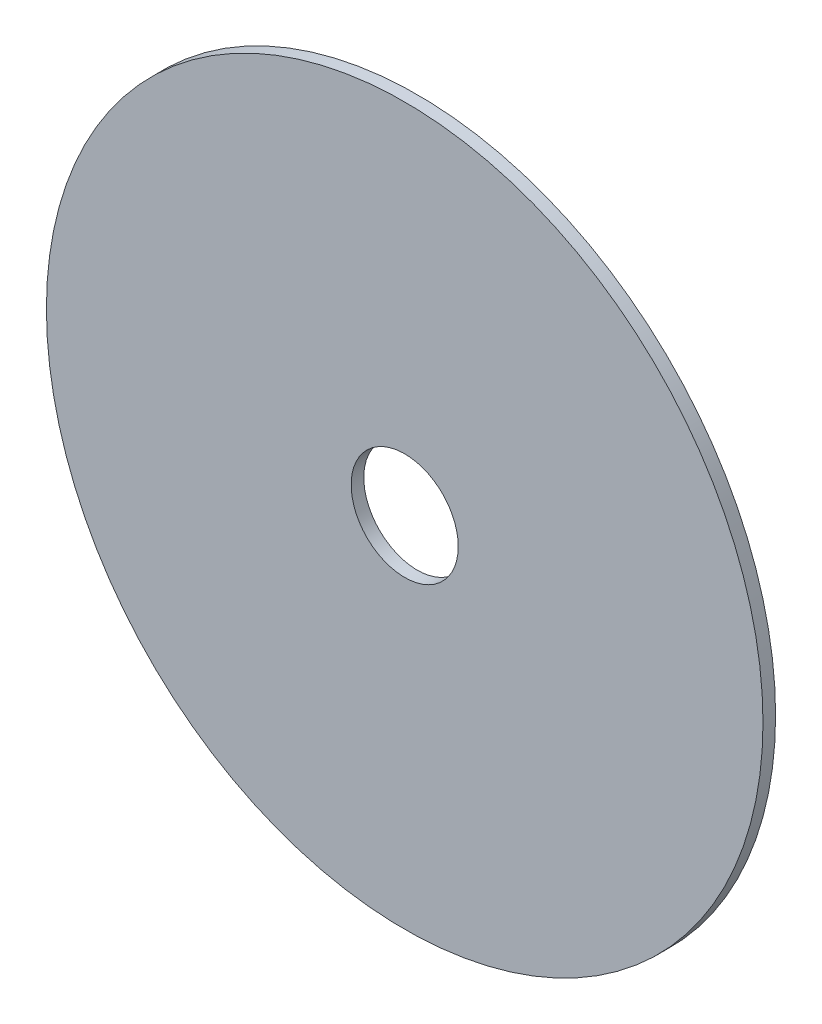
ISO-10303-21;
HEADER;
FILE_DESCRIPTION(('STEP AP214'),'2;1');
FILE_NAME('part.step','',(''),(''),'','','');
FILE_SCHEMA(('AUTOMOTIVE_DESIGN { 1 0 10303 214 1 1 1 1 }'));
ENDSEC;
DATA;
#1=APPLICATION_CONTEXT('core data for automotive mechanical design processes');
#2=APPLICATION_PROTOCOL_DEFINITION('international standard','automotive_design',2000,#1);
#3=PRODUCT_CONTEXT('',#1,'mechanical');
#4=PRODUCT('Part','Part','',(#3));
#5=PRODUCT_RELATED_PRODUCT_CATEGORY('part','',(#4));
#6=PRODUCT_DEFINITION_FORMATION('','',#4);
#7=PRODUCT_DEFINITION_CONTEXT('part definition',#1,'design');
#8=PRODUCT_DEFINITION('design','',#6,#7);
#9=PRODUCT_DEFINITION_SHAPE('','',#8);
#10=(LENGTH_UNIT() NAMED_UNIT(*) SI_UNIT(.MILLI.,.METRE.));
#11=(NAMED_UNIT(*) PLANE_ANGLE_UNIT() SI_UNIT($,.RADIAN.));
#12=(NAMED_UNIT(*) SI_UNIT($,.STERADIAN.) SOLID_ANGLE_UNIT());
#13=UNCERTAINTY_MEASURE_WITH_UNIT(LENGTH_MEASURE(1.E-05),#10,'distance_accuracy_value','');
#14=(GEOMETRIC_REPRESENTATION_CONTEXT(3) GLOBAL_UNCERTAINTY_ASSIGNED_CONTEXT((#13)) GLOBAL_UNIT_ASSIGNED_CONTEXT((#10,
#11,#12)) REPRESENTATION_CONTEXT('',''));
#15=CARTESIAN_POINT('',(0.,0.,0.));
#16=DIRECTION('',(0.,0.,1.));
#17=DIRECTION('',(1.,0.,0.));
#18=AXIS2_PLACEMENT_3D('',#15,#16,#17);
#19=CARTESIAN_POINT('',(0.,0.,-0.8));
#20=DIRECTION('',(0.,0.,1.));
#21=DIRECTION('',(1.,0.,0.));
#22=AXIS2_PLACEMENT_3D('',#19,#20,#21);
#23=CYLINDRICAL_SURFACE('',#22,22.75);
#24=CARTESIAN_POINT('',(0.,0.,-0.8));
#25=DIRECTION('',(0.,0.,1.));
#26=DIRECTION('',(1.,0.,0.));
#27=AXIS2_PLACEMENT_3D('',#24,#25,#26);
#28=CIRCLE('',#27,22.75);
#29=CARTESIAN_POINT('',(22.75,0.,-0.8));
#30=VERTEX_POINT('',#29);
#31=EDGE_CURVE('E10',#30,#30,#28,.T.);
#32=ORIENTED_EDGE('',*,*,#31,.T.);
#33=EDGE_LOOP('',(#32));
#34=FACE_BOUND('',#33,.T.);
#35=CARTESIAN_POINT('',(0.,0.,0.));
#36=DIRECTION('',(0.,0.,1.));
#37=DIRECTION('',(1.,0.,0.));
#38=AXIS2_PLACEMENT_3D('',#35,#36,#37);
#39=CIRCLE('',#38,22.75);
#40=CARTESIAN_POINT('',(22.75,0.,0.));
#41=VERTEX_POINT('',#40);
#42=EDGE_CURVE('E36',#41,#41,#39,.T.);
#43=ORIENTED_EDGE('',*,*,#42,.F.);
#44=EDGE_LOOP('',(#43));
#45=FACE_BOUND('',#44,.T.);
#46=ADVANCED_FACE('F33',(#34,#45),#23,.T.);
#47=CARTESIAN_POINT('',(0.,0.,-0.8));
#48=DIRECTION('',(0.,0.,1.));
#49=DIRECTION('',(1.,0.,0.));
#50=AXIS2_PLACEMENT_3D('',#47,#48,#49);
#51=PLANE('',#50);
#52=CARTESIAN_POINT('',(0.,0.,-0.8));
#53=DIRECTION('',(0.,0.,1.));
#54=DIRECTION('',(1.,0.,0.));
#55=AXIS2_PLACEMENT_3D('',#52,#53,#54);
#56=CIRCLE('',#55,3.4);
#57=CARTESIAN_POINT('',(3.4,0.,-0.8));
#58=VERTEX_POINT('',#57);
#59=EDGE_CURVE('E43',#58,#58,#56,.T.);
#60=ORIENTED_EDGE('',*,*,#59,.T.);
#61=EDGE_LOOP('',(#60));
#62=FACE_BOUND('',#61,.T.);
#63=ORIENTED_EDGE('',*,*,#31,.F.);
#64=EDGE_LOOP('',(#63));
#65=FACE_BOUND('',#64,.T.);
#66=ADVANCED_FACE('F51',(#62,#65),#51,.F.);
#67=CARTESIAN_POINT('',(0.,0.,0.));
#68=DIRECTION('',(0.,0.,1.));
#69=DIRECTION('',(1.,0.,0.));
#70=AXIS2_PLACEMENT_3D('',#67,#68,#69);
#71=PLANE('',#70);
#72=CARTESIAN_POINT('',(0.,0.,0.));
#73=DIRECTION('',(0.,0.,1.));
#74=DIRECTION('',(1.,0.,0.));
#75=AXIS2_PLACEMENT_3D('',#72,#73,#74);
#76=CIRCLE('',#75,3.4);
#77=CARTESIAN_POINT('',(3.4,0.,0.));
#78=VERTEX_POINT('',#77);
#79=EDGE_CURVE('E45',#78,#78,#76,.T.);
#80=ORIENTED_EDGE('',*,*,#79,.F.);
#81=EDGE_LOOP('',(#80));
#82=FACE_BOUND('',#81,.T.);
#83=ORIENTED_EDGE('',*,*,#42,.T.);
#84=EDGE_LOOP('',(#83));
#85=FACE_BOUND('',#84,.T.);
#86=ADVANCED_FACE('F57',(#82,#85),#71,.T.);
#87=CARTESIAN_POINT('',(0.,0.,-0.8));
#88=DIRECTION('',(0.,0.,1.));
#89=DIRECTION('',(1.,0.,0.));
#90=AXIS2_PLACEMENT_3D('',#87,#88,#89);
#91=CYLINDRICAL_SURFACE('',#90,3.4);
#92=ORIENTED_EDGE('',*,*,#59,.F.);
#93=EDGE_LOOP('',(#92));
#94=FACE_BOUND('',#93,.T.);
#95=ORIENTED_EDGE('',*,*,#79,.T.);
#96=EDGE_LOOP('',(#95));
#97=FACE_BOUND('',#96,.T.);
#98=ADVANCED_FACE('F54',(#94,#97),#91,.F.);
#99=CLOSED_SHELL('',(#46,#66,#86,#98));
#100=MANIFOLD_SOLID_BREP('B2',#99);
#101=ADVANCED_BREP_SHAPE_REPRESENTATION('',(#18,#100),#14);
#102=SHAPE_DEFINITION_REPRESENTATION(#9,#101);
ENDSEC;
END-ISO-10303-21;
